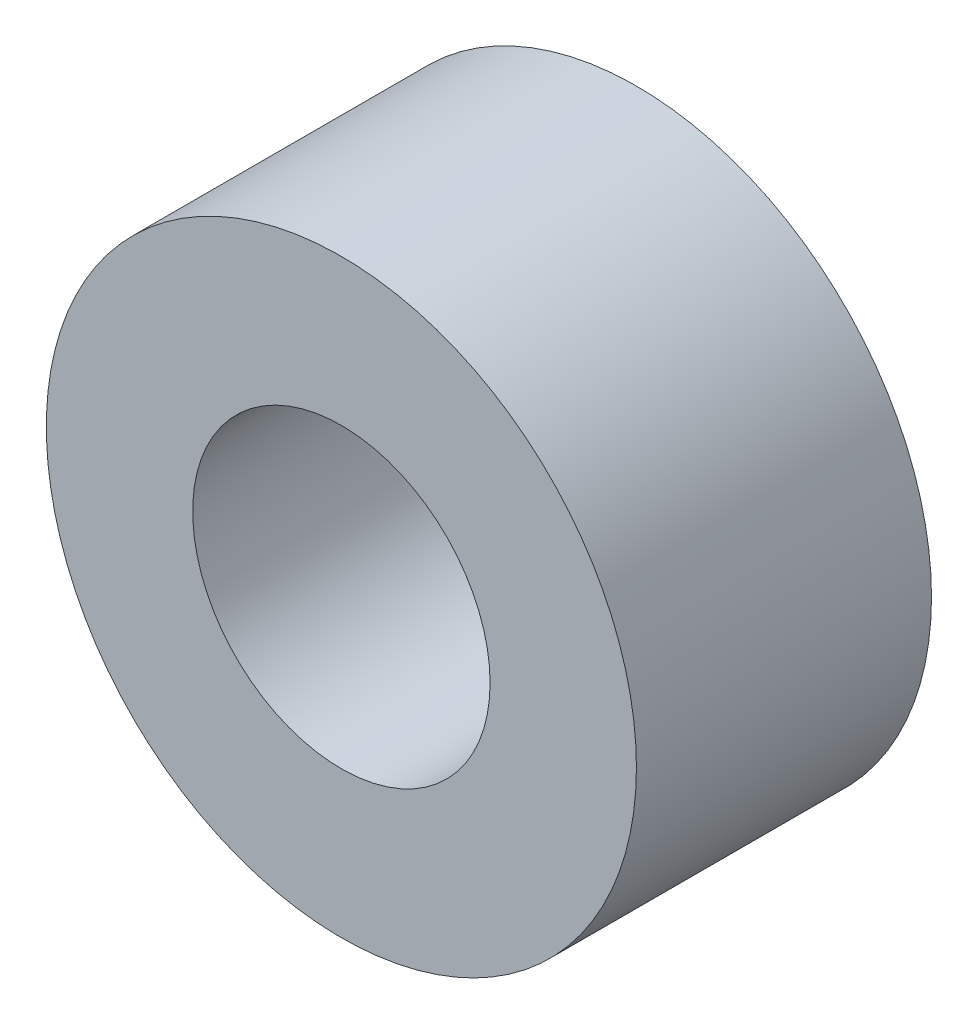
ISO-10303-21;
HEADER;
FILE_DESCRIPTION(('STEP AP214'),'2;1');
FILE_NAME('part.step','',(''),(''),'','','');
FILE_SCHEMA(('AUTOMOTIVE_DESIGN { 1 0 10303 214 1 1 1 1 }'));
ENDSEC;
DATA;
#1=APPLICATION_CONTEXT('core data for automotive mechanical design processes');
#2=APPLICATION_PROTOCOL_DEFINITION('international standard','automotive_design',2000,#1);
#3=PRODUCT_CONTEXT('',#1,'mechanical');
#4=PRODUCT('Part','Part','',(#3));
#5=PRODUCT_RELATED_PRODUCT_CATEGORY('part','',(#4));
#6=PRODUCT_DEFINITION_FORMATION('','',#4);
#7=PRODUCT_DEFINITION_CONTEXT('part definition',#1,'design');
#8=PRODUCT_DEFINITION('design','',#6,#7);
#9=PRODUCT_DEFINITION_SHAPE('','',#8);
#10=(LENGTH_UNIT() NAMED_UNIT(*) SI_UNIT(.MILLI.,.METRE.));
#11=(NAMED_UNIT(*) PLANE_ANGLE_UNIT() SI_UNIT($,.RADIAN.));
#12=(NAMED_UNIT(*) SI_UNIT($,.STERADIAN.) SOLID_ANGLE_UNIT());
#13=UNCERTAINTY_MEASURE_WITH_UNIT(LENGTH_MEASURE(1.E-05),#10,'distance_accuracy_value','');
#14=(GEOMETRIC_REPRESENTATION_CONTEXT(3) GLOBAL_UNCERTAINTY_ASSIGNED_CONTEXT((#13)) GLOBAL_UNIT_ASSIGNED_CONTEXT((#10,
#11,#12)) REPRESENTATION_CONTEXT('',''));
#15=CARTESIAN_POINT('',(0.,0.,0.));
#16=DIRECTION('',(0.,0.,1.));
#17=DIRECTION('',(1.,0.,0.));
#18=AXIS2_PLACEMENT_3D('',#15,#16,#17);
#19=CARTESIAN_POINT('',(0.,0.,3.175));
#20=DIRECTION('',(0.,0.,1.));
#21=DIRECTION('',(1.,0.,0.));
#22=AXIS2_PLACEMENT_3D('',#19,#20,#21);
#23=PLANE('',#22);
#24=CARTESIAN_POINT('',(0.,0.,3.175));
#25=DIRECTION('',(0.,0.,1.));
#26=DIRECTION('',(1.,0.,0.));
#27=AXIS2_PLACEMENT_3D('',#24,#25,#26);
#28=CIRCLE('',#27,6.35);
#29=CARTESIAN_POINT('',(6.35,0.,3.175));
#30=VERTEX_POINT('',#29);
#31=EDGE_CURVE('E10',#30,#30,#28,.T.);
#32=ORIENTED_EDGE('',*,*,#31,.T.);
#33=EDGE_LOOP('',(#32));
#34=FACE_BOUND('',#33,.T.);
#35=CARTESIAN_POINT('',(0.,0.,3.175));
#36=DIRECTION('',(0.,0.,1.));
#37=DIRECTION('',(1.,0.,0.));
#38=AXIS2_PLACEMENT_3D('',#35,#36,#37);
#39=CIRCLE('',#38,3.2004);
#40=CARTESIAN_POINT('',(3.2004,0.,3.175));
#41=VERTEX_POINT('',#40);
#42=EDGE_CURVE('E35',#41,#41,#39,.T.);
#43=ORIENTED_EDGE('',*,*,#42,.F.);
#44=EDGE_LOOP('',(#43));
#45=FACE_BOUND('',#44,.T.);
#46=ADVANCED_FACE('F28',(#34,#45),#23,.T.);
#47=CARTESIAN_POINT('',(0.,0.,3.175));
#48=DIRECTION('',(0.,0.,-1.));
#49=DIRECTION('',(-1.,0.,0.));
#50=AXIS2_PLACEMENT_3D('',#47,#48,#49);
#51=CYLINDRICAL_SURFACE('',#50,6.35);
#52=ORIENTED_EDGE('',*,*,#31,.F.);
#53=EDGE_LOOP('',(#52));
#54=FACE_BOUND('',#53,.T.);
#55=CARTESIAN_POINT('',(0.,0.,-3.175));
#56=DIRECTION('',(0.,0.,1.));
#57=DIRECTION('',(1.,0.,0.));
#58=AXIS2_PLACEMENT_3D('',#55,#56,#57);
#59=CIRCLE('',#58,6.35);
#60=CARTESIAN_POINT('',(6.35,0.,-3.175));
#61=VERTEX_POINT('',#60);
#62=EDGE_CURVE('E39',#61,#61,#59,.T.);
#63=ORIENTED_EDGE('',*,*,#62,.T.);
#64=EDGE_LOOP('',(#63));
#65=FACE_BOUND('',#64,.T.);
#66=ADVANCED_FACE('F30',(#54,#65),#51,.T.);
#67=CARTESIAN_POINT('',(0.,0.,3.175));
#68=DIRECTION('',(0.,0.,-1.));
#69=DIRECTION('',(-1.,0.,0.));
#70=AXIS2_PLACEMENT_3D('',#67,#68,#69);
#71=CYLINDRICAL_SURFACE('',#70,3.2004);
#72=ORIENTED_EDGE('',*,*,#42,.T.);
#73=EDGE_LOOP('',(#72));
#74=FACE_BOUND('',#73,.T.);
#75=CARTESIAN_POINT('',(0.,0.,-3.175));
#76=DIRECTION('',(0.,0.,1.));
#77=DIRECTION('',(1.,0.,0.));
#78=AXIS2_PLACEMENT_3D('',#75,#76,#77);
#79=CIRCLE('',#78,3.2004);
#80=CARTESIAN_POINT('',(3.2004,0.,-3.175));
#81=VERTEX_POINT('',#80);
#82=EDGE_CURVE('E43',#81,#81,#79,.T.);
#83=ORIENTED_EDGE('',*,*,#82,.F.);
#84=EDGE_LOOP('',(#83));
#85=FACE_BOUND('',#84,.T.);
#86=ADVANCED_FACE('F52',(#74,#85),#71,.F.);
#87=CARTESIAN_POINT('',(0.,0.,-3.175));
#88=DIRECTION('',(0.,0.,1.));
#89=DIRECTION('',(1.,0.,0.));
#90=AXIS2_PLACEMENT_3D('',#87,#88,#89);
#91=PLANE('',#90);
#92=ORIENTED_EDGE('',*,*,#82,.T.);
#93=EDGE_LOOP('',(#92));
#94=FACE_BOUND('',#93,.T.);
#95=ORIENTED_EDGE('',*,*,#62,.F.);
#96=EDGE_LOOP('',(#95));
#97=FACE_BOUND('',#96,.T.);
#98=ADVANCED_FACE('F49',(#94,#97),#91,.F.);
#99=CLOSED_SHELL('',(#46,#66,#86,#98));
#100=MANIFOLD_SOLID_BREP('B2',#99);
#101=ADVANCED_BREP_SHAPE_REPRESENTATION('',(#18,#100),#14);
#102=SHAPE_DEFINITION_REPRESENTATION(#9,#101);
ENDSEC;
END-ISO-10303-21;
